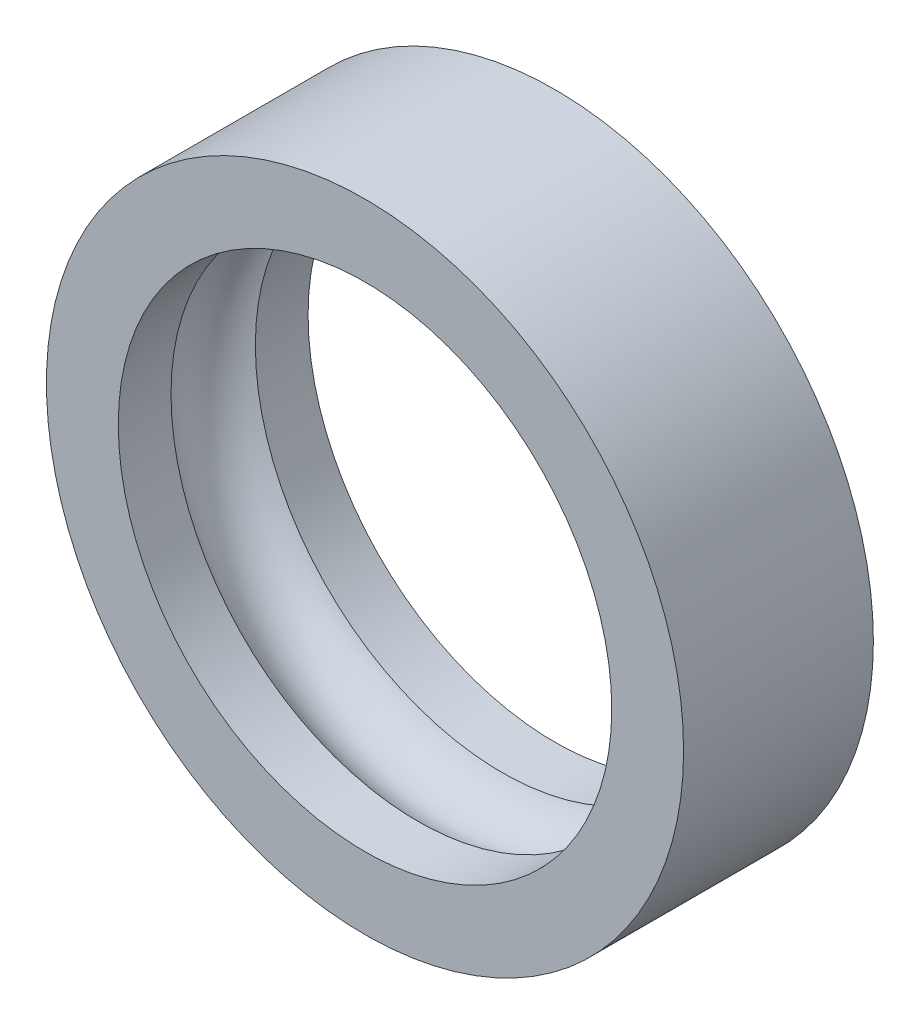
ISO-10303-21;
HEADER;
FILE_DESCRIPTION(('STEP AP214'),'2;1');
FILE_NAME('part.step','',(''),(''),'','','');
FILE_SCHEMA(('AUTOMOTIVE_DESIGN { 1 0 10303 214 1 1 1 1 }'));
ENDSEC;
DATA;
#1=APPLICATION_CONTEXT('core data for automotive mechanical design processes');
#2=APPLICATION_PROTOCOL_DEFINITION('international standard','automotive_design',2000,#1);
#3=PRODUCT_CONTEXT('',#1,'mechanical');
#4=PRODUCT('Part','Part','',(#3));
#5=PRODUCT_RELATED_PRODUCT_CATEGORY('part','',(#4));
#6=PRODUCT_DEFINITION_FORMATION('','',#4);
#7=PRODUCT_DEFINITION_CONTEXT('part definition',#1,'design');
#8=PRODUCT_DEFINITION('design','',#6,#7);
#9=PRODUCT_DEFINITION_SHAPE('','',#8);
#10=(LENGTH_UNIT() NAMED_UNIT(*) SI_UNIT(.MILLI.,.METRE.));
#11=(NAMED_UNIT(*) PLANE_ANGLE_UNIT() SI_UNIT($,.RADIAN.));
#12=(NAMED_UNIT(*) SI_UNIT($,.STERADIAN.) SOLID_ANGLE_UNIT());
#13=UNCERTAINTY_MEASURE_WITH_UNIT(LENGTH_MEASURE(1.E-05),#10,'distance_accuracy_value','');
#14=(GEOMETRIC_REPRESENTATION_CONTEXT(3) GLOBAL_UNCERTAINTY_ASSIGNED_CONTEXT((#13)) GLOBAL_UNIT_ASSIGNED_CONTEXT((#10,
#11,#12)) REPRESENTATION_CONTEXT('',''));
#15=CARTESIAN_POINT('',(0.,0.,0.));
#16=DIRECTION('',(0.,0.,1.));
#17=DIRECTION('',(1.,0.,0.));
#18=AXIS2_PLACEMENT_3D('',#15,#16,#17);
#19=CARTESIAN_POINT('',(0.,0.,7.));
#20=DIRECTION('',(0.,0.,1.));
#21=DIRECTION('',(1.,0.,0.));
#22=AXIS2_PLACEMENT_3D('',#19,#20,#21);
#23=CYLINDRICAL_SURFACE('',#22,23.5);
#24=CARTESIAN_POINT('',(0.,0.,7.));
#25=DIRECTION('',(0.,0.,1.));
#26=DIRECTION('',(1.,0.,0.));
#27=AXIS2_PLACEMENT_3D('',#24,#25,#26);
#28=CIRCLE('',#27,23.5);
#29=CARTESIAN_POINT('',(23.5,0.,7.));
#30=VERTEX_POINT('',#29);
#31=EDGE_CURVE('E57',#30,#30,#28,.T.);
#32=ORIENTED_EDGE('',*,*,#31,.F.);
#33=EDGE_LOOP('',(#32));
#34=FACE_BOUND('',#33,.T.);
#35=CARTESIAN_POINT('',(0.,0.,-7.));
#36=DIRECTION('',(0.,0.,1.));
#37=DIRECTION('',(1.,0.,0.));
#38=AXIS2_PLACEMENT_3D('',#35,#36,#37);
#39=CIRCLE('',#38,23.5);
#40=CARTESIAN_POINT('',(23.5,0.,-7.));
#41=VERTEX_POINT('',#40);
#42=EDGE_CURVE('E10',#41,#41,#39,.T.);
#43=ORIENTED_EDGE('',*,*,#42,.T.);
#44=EDGE_LOOP('',(#43));
#45=FACE_BOUND('',#44,.T.);
#46=ADVANCED_FACE('F35',(#34,#45),#23,.T.);
#47=CARTESIAN_POINT('',(0.,22.8,-7.));
#48=DIRECTION('',(0.,0.,1.));
#49=DIRECTION('',(1.,0.,0.));
#50=AXIS2_PLACEMENT_3D('',#47,#48,#49);
#51=PLANE('',#50);
#52=ORIENTED_EDGE('',*,*,#42,.F.);
#53=EDGE_LOOP('',(#52));
#54=FACE_BOUND('',#53,.T.);
#55=CARTESIAN_POINT('',(0.,0.,-7.00000000000001));
#56=DIRECTION('',(0.,0.,1.));
#57=DIRECTION('',(1.,0.,0.));
#58=AXIS2_PLACEMENT_3D('',#55,#56,#57);
#59=CIRCLE('',#58,18.2005494505494);
#60=CARTESIAN_POINT('',(18.2005494505494,0.,-7.00000000000001));
#61=VERTEX_POINT('',#60);
#62=EDGE_CURVE('E41',#61,#61,#59,.T.);
#63=ORIENTED_EDGE('',*,*,#62,.T.);
#64=EDGE_LOOP('',(#63));
#65=FACE_BOUND('',#64,.T.);
#66=ADVANCED_FACE('F64',(#54,#65),#51,.F.);
#67=CARTESIAN_POINT('',(0.,0.,7.));
#68=DIRECTION('',(0.,0.,1.));
#69=DIRECTION('',(1.,0.,0.));
#70=AXIS2_PLACEMENT_3D('',#67,#68,#69);
#71=CYLINDRICAL_SURFACE('',#70,18.2005494505494);
#72=ORIENTED_EDGE('',*,*,#62,.F.);
#73=EDGE_LOOP('',(#72));
#74=FACE_BOUND('',#73,.T.);
#75=CARTESIAN_POINT('',(0.,0.,-3.11111111111111));
#76=DIRECTION('',(0.,0.,1.));
#77=DIRECTION('',(1.,0.,0.));
#78=AXIS2_PLACEMENT_3D('',#75,#76,#77);
#79=CIRCLE('',#78,18.2005494505494);
#80=CARTESIAN_POINT('',(18.2005494505494,0.,-3.11111111111111));
#81=VERTEX_POINT('',#80);
#82=EDGE_CURVE('E45',#81,#81,#79,.T.);
#83=ORIENTED_EDGE('',*,*,#82,.T.);
#84=EDGE_LOOP('',(#83));
#85=FACE_BOUND('',#84,.T.);
#86=ADVANCED_FACE('F68',(#74,#85),#71,.F.);
#87=CARTESIAN_POINT('',(0.,0.,0.));
#88=DIRECTION('',(0.,0.,1.));
#89=DIRECTION('',(1.,0.,0.));
#90=AXIS2_PLACEMENT_3D('',#87,#88,#89);
#91=TOROIDAL_SURFACE('',#90,16.75,3.43265291781274);
#92=ORIENTED_EDGE('',*,*,#82,.F.);
#93=EDGE_LOOP('',(#92));
#94=FACE_BOUND('',#93,.T.);
#95=CARTESIAN_POINT('',(0.,0.,3.11111111111111));
#96=DIRECTION('',(0.,0.,1.));
#97=DIRECTION('',(1.,0.,0.));
#98=AXIS2_PLACEMENT_3D('',#95,#96,#97);
#99=CIRCLE('',#98,18.2005494505494);
#100=CARTESIAN_POINT('',(18.2005494505494,0.,3.11111111111111));
#101=VERTEX_POINT('',#100);
#102=EDGE_CURVE('E49',#101,#101,#99,.T.);
#103=ORIENTED_EDGE('',*,*,#102,.T.);
#104=EDGE_LOOP('',(#103));
#105=FACE_BOUND('',#104,.T.);
#106=ADVANCED_FACE('F73',(#94,#105),#91,.F.);
#107=CARTESIAN_POINT('',(0.,0.,7.));
#108=DIRECTION('',(0.,0.,1.));
#109=DIRECTION('',(1.,0.,0.));
#110=AXIS2_PLACEMENT_3D('',#107,#108,#109);
#111=CYLINDRICAL_SURFACE('',#110,18.2005494505494);
#112=ORIENTED_EDGE('',*,*,#102,.F.);
#113=EDGE_LOOP('',(#112));
#114=FACE_BOUND('',#113,.T.);
#115=CARTESIAN_POINT('',(0.,0.,7.));
#116=DIRECTION('',(0.,0.,1.));
#117=DIRECTION('',(1.,0.,0.));
#118=AXIS2_PLACEMENT_3D('',#115,#116,#117);
#119=CIRCLE('',#118,18.2005494505494);
#120=CARTESIAN_POINT('',(18.2005494505494,0.,7.));
#121=VERTEX_POINT('',#120);
#122=EDGE_CURVE('E54',#121,#121,#119,.T.);
#123=ORIENTED_EDGE('',*,*,#122,.T.);
#124=EDGE_LOOP('',(#123));
#125=FACE_BOUND('',#124,.T.);
#126=ADVANCED_FACE('F79',(#114,#125),#111,.F.);
#127=CARTESIAN_POINT('',(0.,22.8,7.));
#128=DIRECTION('',(0.,0.,-1.));
#129=DIRECTION('',(-1.,0.,0.));
#130=AXIS2_PLACEMENT_3D('',#127,#128,#129);
#131=PLANE('',#130);
#132=ORIENTED_EDGE('',*,*,#122,.F.);
#133=EDGE_LOOP('',(#132));
#134=FACE_BOUND('',#133,.T.);
#135=ORIENTED_EDGE('',*,*,#31,.T.);
#136=EDGE_LOOP('',(#135));
#137=FACE_BOUND('',#136,.T.);
#138=ADVANCED_FACE('F61',(#134,#137),#131,.F.);
#139=CLOSED_SHELL('',(#46,#66,#86,#106,#126,#138));
#140=MANIFOLD_SOLID_BREP('B2',#139);
#141=ADVANCED_BREP_SHAPE_REPRESENTATION('',(#18,#140),#14);
#142=SHAPE_DEFINITION_REPRESENTATION(#9,#141);
ENDSEC;
END-ISO-10303-21;
